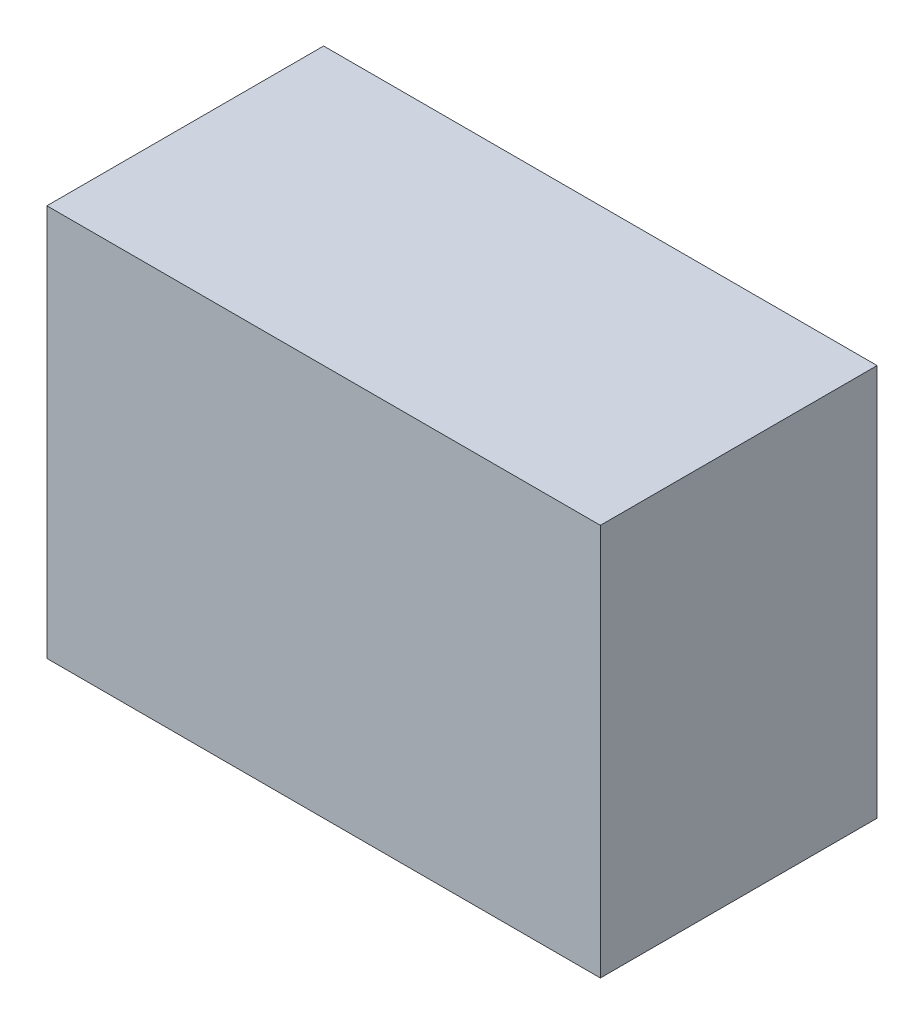
ISO-10303-21;
HEADER;
FILE_DESCRIPTION(('STEP AP214'),'2;1');
FILE_NAME('part.step','',(''),(''),'','','');
FILE_SCHEMA(('AUTOMOTIVE_DESIGN { 1 0 10303 214 1 1 1 1 }'));
ENDSEC;
DATA;
#1=APPLICATION_CONTEXT('core data for automotive mechanical design processes');
#2=APPLICATION_PROTOCOL_DEFINITION('international standard','automotive_design',2000,#1);
#3=PRODUCT_CONTEXT('',#1,'mechanical');
#4=PRODUCT('Part','Part','',(#3));
#5=PRODUCT_RELATED_PRODUCT_CATEGORY('part','',(#4));
#6=PRODUCT_DEFINITION_FORMATION('','',#4);
#7=PRODUCT_DEFINITION_CONTEXT('part definition',#1,'design');
#8=PRODUCT_DEFINITION('design','',#6,#7);
#9=PRODUCT_DEFINITION_SHAPE('','',#8);
#10=(LENGTH_UNIT() NAMED_UNIT(*) SI_UNIT(.MILLI.,.METRE.));
#11=(NAMED_UNIT(*) PLANE_ANGLE_UNIT() SI_UNIT($,.RADIAN.));
#12=(NAMED_UNIT(*) SI_UNIT($,.STERADIAN.) SOLID_ANGLE_UNIT());
#13=UNCERTAINTY_MEASURE_WITH_UNIT(LENGTH_MEASURE(1.E-05),#10,'distance_accuracy_value','');
#14=(GEOMETRIC_REPRESENTATION_CONTEXT(3) GLOBAL_UNCERTAINTY_ASSIGNED_CONTEXT((#13)) GLOBAL_UNIT_ASSIGNED_CONTEXT((#10,
#11,#12)) REPRESENTATION_CONTEXT('',''));
#15=CARTESIAN_POINT('',(0.,0.,0.));
#16=DIRECTION('',(0.,0.,1.));
#17=DIRECTION('',(1.,0.,0.));
#18=AXIS2_PLACEMENT_3D('',#15,#16,#17);
#19=CARTESIAN_POINT('',(-24.,34.,12.5453020134228));
#20=DIRECTION('',(0.,0.,-1.));
#21=DIRECTION('',(-1.,0.,0.));
#22=AXIS2_PLACEMENT_3D('',#19,#20,#21);
#23=PLANE('',#22);
#24=DIRECTION('',(1.,0.,0.));
#25=VECTOR('',#24,1.);
#26=CARTESIAN_POINT('',(-24.,0.,12.5453020134228));
#27=LINE('',#26,#25);
#28=CARTESIAN_POINT('',(-15.5,0.,12.5453020134228));
#29=VERTEX_POINT('',#28);
#30=CARTESIAN_POINT('',(15.5,0.,12.5453020134228));
#31=VERTEX_POINT('',#30);
#32=EDGE_CURVE('E48',#29,#31,#27,.T.);
#33=ORIENTED_EDGE('',*,*,#32,.F.);
#34=DIRECTION('',(0.,1.,0.));
#35=VECTOR('',#34,1.);
#36=CARTESIAN_POINT('',(-15.5,-18.3334139847093,12.5453020134228));
#37=LINE('',#36,#35);
#38=CARTESIAN_POINT('',(-15.5,32.,12.5453020134228));
#39=VERTEX_POINT('',#38);
#40=EDGE_CURVE('E295',#29,#39,#37,.T.);
#41=ORIENTED_EDGE('',*,*,#40,.T.);
#42=DIRECTION('',(1.,0.,0.));
#43=VECTOR('',#42,1.);
#44=CARTESIAN_POINT('',(-24.,32.,12.5453020134228));
#45=LINE('',#44,#43);
#46=CARTESIAN_POINT('',(15.5,32.,12.5453020134228));
#47=VERTEX_POINT('',#46);
#48=EDGE_CURVE('E173',#39,#47,#45,.T.);
#49=ORIENTED_EDGE('',*,*,#48,.T.);
#50=DIRECTION('',(0.,1.,0.));
#51=VECTOR('',#50,1.);
#52=CARTESIAN_POINT('',(15.5,-18.3334139847093,12.5453020134228));
#53=LINE('',#52,#51);
#54=EDGE_CURVE('E278',#31,#47,#53,.T.);
#55=ORIENTED_EDGE('',*,*,#54,.F.);
#56=EDGE_LOOP('',(#33,#41,#49,#55));
#57=FACE_BOUND('',#56,.T.);
#58=ADVANCED_FACE('F33',(#57),#23,.T.);
#59=CARTESIAN_POINT('',(0.,32.,0.));
#60=DIRECTION('',(0.,1.,0.));
#61=DIRECTION('',(0.,0.,1.));
#62=AXIS2_PLACEMENT_3D('',#59,#60,#61);
#63=PLANE('',#62);
#64=DIRECTION('',(0.,0.,1.));
#65=VECTOR('',#64,1.);
#66=CARTESIAN_POINT('',(-15.5,32.,-4.59716187992498));
#67=LINE('',#66,#65);
#68=CARTESIAN_POINT('',(-15.5,32.,-4.59716187992498));
#69=VERTEX_POINT('',#68);
#70=EDGE_CURVE('E166',#69,#39,#67,.T.);
#71=ORIENTED_EDGE('',*,*,#70,.F.);
#72=DIRECTION('',(1.,0.,0.));
#73=VECTOR('',#72,1.);
#74=CARTESIAN_POINT('',(-22.,32.,-4.59716187992498));
#75=LINE('',#74,#73);
#76=CARTESIAN_POINT('',(-22.,32.,-4.59716187992498));
#77=VERTEX_POINT('',#76);
#78=EDGE_CURVE('E150',#77,#69,#75,.T.);
#79=ORIENTED_EDGE('',*,*,#78,.F.);
#80=DIRECTION('',(0.,0.,1.));
#81=VECTOR('',#80,1.);
#82=CARTESIAN_POINT('',(-22.,32.,-9.45469798657719));
#83=LINE('',#82,#81);
#84=CARTESIAN_POINT('',(-22.,32.,-7.45469798657719));
#85=VERTEX_POINT('',#84);
#86=EDGE_CURVE('E164',#85,#77,#83,.T.);
#87=ORIENTED_EDGE('',*,*,#86,.F.);
#88=DIRECTION('',(-1.,0.,0.));
#89=VECTOR('',#88,1.);
#90=CARTESIAN_POINT('',(-24.,32.,-7.45469798657719));
#91=LINE('',#90,#89);
#92=CARTESIAN_POINT('',(22.,32.,-7.45469798657719));
#93=VERTEX_POINT('',#92);
#94=EDGE_CURVE('E186',#93,#85,#91,.T.);
#95=ORIENTED_EDGE('',*,*,#94,.F.);
#96=DIRECTION('',(0.,0.,-1.));
#97=VECTOR('',#96,1.);
#98=CARTESIAN_POINT('',(22.,32.,-9.45469798657719));
#99=LINE('',#98,#97);
#100=CARTESIAN_POINT('',(22.,32.,-4.59716187992498));
#101=VERTEX_POINT('',#100);
#102=EDGE_CURVE('E176',#101,#93,#99,.T.);
#103=ORIENTED_EDGE('',*,*,#102,.F.);
#104=DIRECTION('',(1.,0.,0.));
#105=VECTOR('',#104,1.);
#106=CARTESIAN_POINT('',(22.,32.,-4.59716187992498));
#107=LINE('',#106,#105);
#108=CARTESIAN_POINT('',(15.5,32.,-4.59716187992498));
#109=VERTEX_POINT('',#108);
#110=EDGE_CURVE('E286',#109,#101,#107,.T.);
#111=ORIENTED_EDGE('',*,*,#110,.F.);
#112=DIRECTION('',(0.,0.,-1.));
#113=VECTOR('',#112,1.);
#114=CARTESIAN_POINT('',(15.5,32.,-4.59716187992498));
#115=LINE('',#114,#113);
#116=EDGE_CURVE('E289',#47,#109,#115,.T.);
#117=ORIENTED_EDGE('',*,*,#116,.F.);
#118=ORIENTED_EDGE('',*,*,#48,.F.);
#119=EDGE_LOOP('',(#71,#79,#87,#95,#103,#111,#117,#118));
#120=FACE_BOUND('',#119,.T.);
#121=ADVANCED_FACE('F162',(#120),#63,.F.);
#122=CARTESIAN_POINT('',(-22.,34.,-9.45469798657719));
#123=DIRECTION('',(1.,0.,0.));
#124=DIRECTION('',(0.,0.,-1.));
#125=AXIS2_PLACEMENT_3D('',#122,#123,#124);
#126=PLANE('',#125);
#127=ORIENTED_EDGE('',*,*,#86,.T.);
#128=DIRECTION('',(0.,1.,0.));
#129=VECTOR('',#128,1.);
#130=CARTESIAN_POINT('',(-22.,-18.3334139847093,-4.59716187992498));
#131=LINE('',#130,#129);
#132=CARTESIAN_POINT('',(-22.,0.,-4.59716187992498));
#133=VERTEX_POINT('',#132);
#134=EDGE_CURVE('E146',#133,#77,#131,.T.);
#135=ORIENTED_EDGE('',*,*,#134,.F.);
#136=DIRECTION('',(0.,0.,1.));
#137=VECTOR('',#136,1.);
#138=CARTESIAN_POINT('',(-22.,0.,-9.45469798657719));
#139=LINE('',#138,#137);
#140=CARTESIAN_POINT('',(-22.,0.,-7.45469798657719));
#141=VERTEX_POINT('',#140);
#142=EDGE_CURVE('E192',#141,#133,#139,.T.);
#143=ORIENTED_EDGE('',*,*,#142,.F.);
#144=DIRECTION('',(0.,-1.,0.));
#145=VECTOR('',#144,1.);
#146=CARTESIAN_POINT('',(-22.,34.,-7.45469798657719));
#147=LINE('',#146,#145);
#148=EDGE_CURVE('E172',#85,#141,#147,.T.);
#149=ORIENTED_EDGE('',*,*,#148,.F.);
#150=EDGE_LOOP('',(#127,#135,#143,#149));
#151=FACE_BOUND('',#150,.T.);
#152=ADVANCED_FACE('F170',(#151),#126,.T.);
#153=CARTESIAN_POINT('',(22.,34.,-9.45469798657719));
#154=DIRECTION('',(-1.,0.,0.));
#155=DIRECTION('',(0.,0.,1.));
#156=AXIS2_PLACEMENT_3D('',#153,#154,#155);
#157=PLANE('',#156);
#158=DIRECTION('',(0.,0.,-1.));
#159=VECTOR('',#158,1.);
#160=CARTESIAN_POINT('',(22.,0.,-9.45469798657719));
#161=LINE('',#160,#159);
#162=CARTESIAN_POINT('',(22.,0.,-4.59716187992498));
#163=VERTEX_POINT('',#162);
#164=CARTESIAN_POINT('',(22.,0.,-7.45469798657719));
#165=VERTEX_POINT('',#164);
#166=EDGE_CURVE('E56',#163,#165,#161,.T.);
#167=ORIENTED_EDGE('',*,*,#166,.F.);
#168=DIRECTION('',(0.,1.,0.));
#169=VECTOR('',#168,1.);
#170=CARTESIAN_POINT('',(22.,-18.3334139847093,-4.59716187992498));
#171=LINE('',#170,#169);
#172=EDGE_CURVE('E284',#163,#101,#171,.T.);
#173=ORIENTED_EDGE('',*,*,#172,.T.);
#174=ORIENTED_EDGE('',*,*,#102,.T.);
#175=DIRECTION('',(0.,-1.,0.));
#176=VECTOR('',#175,1.);
#177=CARTESIAN_POINT('',(22.,34.,-7.45469798657719));
#178=LINE('',#177,#176);
#179=EDGE_CURVE('E185',#93,#165,#178,.T.);
#180=ORIENTED_EDGE('',*,*,#179,.T.);
#181=EDGE_LOOP('',(#167,#173,#174,#180));
#182=FACE_BOUND('',#181,.T.);
#183=ADVANCED_FACE('F353',(#182),#157,.T.);
#184=CARTESIAN_POINT('',(-24.,34.,-9.45469798657719));
#185=DIRECTION('',(1.,0.,0.));
#186=DIRECTION('',(0.,0.,-1.));
#187=AXIS2_PLACEMENT_3D('',#184,#185,#186);
#188=PLANE('',#187);
#189=DIRECTION('',(0.,0.,1.));
#190=VECTOR('',#189,1.);
#191=CARTESIAN_POINT('',(-24.,0.,-9.45469798657719));
#192=LINE('',#191,#190);
#193=CARTESIAN_POINT('',(-24.,0.,-9.45469798657719));
#194=VERTEX_POINT('',#193);
#195=CARTESIAN_POINT('',(-24.,0.,14.5453020134228));
#196=VERTEX_POINT('',#195);
#197=EDGE_CURVE('E189',#194,#196,#192,.T.);
#198=ORIENTED_EDGE('',*,*,#197,.T.);
#199=DIRECTION('',(0.,-1.,0.));
#200=VECTOR('',#199,1.);
#201=CARTESIAN_POINT('',(-24.,34.,14.5453020134228));
#202=LINE('',#201,#200);
#203=CARTESIAN_POINT('',(-24.,34.,14.5453020134228));
#204=VERTEX_POINT('',#203);
#205=EDGE_CURVE('E11',#204,#196,#202,.T.);
#206=ORIENTED_EDGE('',*,*,#205,.F.);
#207=DIRECTION('',(0.,0.,1.));
#208=VECTOR('',#207,1.);
#209=CARTESIAN_POINT('',(-24.,34.,-9.45469798657719));
#210=LINE('',#209,#208);
#211=CARTESIAN_POINT('',(-24.,34.,-9.45469798657719));
#212=VERTEX_POINT('',#211);
#213=EDGE_CURVE('E197',#212,#204,#210,.T.);
#214=ORIENTED_EDGE('',*,*,#213,.F.);
#215=DIRECTION('',(0.,-1.,0.));
#216=VECTOR('',#215,1.);
#217=CARTESIAN_POINT('',(-24.,34.,-9.45469798657719));
#218=LINE('',#217,#216);
#219=EDGE_CURVE('E207',#212,#194,#218,.T.);
#220=ORIENTED_EDGE('',*,*,#219,.T.);
#221=EDGE_LOOP('',(#198,#206,#214,#220));
#222=FACE_BOUND('',#221,.T.);
#223=ADVANCED_FACE('F35',(#222),#188,.F.);
#224=CARTESIAN_POINT('',(-24.,34.,14.5453020134228));
#225=DIRECTION('',(0.,0.,-1.));
#226=DIRECTION('',(-1.,0.,0.));
#227=AXIS2_PLACEMENT_3D('',#224,#225,#226);
#228=PLANE('',#227);
#229=DIRECTION('',(1.,0.,0.));
#230=VECTOR('',#229,1.);
#231=CARTESIAN_POINT('',(-24.,0.,14.5453020134228));
#232=LINE('',#231,#230);
#233=CARTESIAN_POINT('',(24.,0.,14.5453020134228));
#234=VERTEX_POINT('',#233);
#235=EDGE_CURVE('E210',#196,#234,#232,.T.);
#236=ORIENTED_EDGE('',*,*,#235,.T.);
#237=DIRECTION('',(0.,-1.,0.));
#238=VECTOR('',#237,1.);
#239=CARTESIAN_POINT('',(24.,34.,14.5453020134228));
#240=LINE('',#239,#238);
#241=CARTESIAN_POINT('',(24.,34.,14.5453020134228));
#242=VERTEX_POINT('',#241);
#243=EDGE_CURVE('E41',#242,#234,#240,.T.);
#244=ORIENTED_EDGE('',*,*,#243,.F.);
#245=DIRECTION('',(1.,0.,0.));
#246=VECTOR('',#245,1.);
#247=CARTESIAN_POINT('',(-24.,34.,14.5453020134228));
#248=LINE('',#247,#246);
#249=EDGE_CURVE('E200',#204,#242,#248,.T.);
#250=ORIENTED_EDGE('',*,*,#249,.F.);
#251=ORIENTED_EDGE('',*,*,#205,.T.);
#252=EDGE_LOOP('',(#236,#244,#250,#251));
#253=FACE_BOUND('',#252,.T.);
#254=ADVANCED_FACE('F244',(#253),#228,.F.);
#255=CARTESIAN_POINT('',(24.,34.,-9.45469798657719));
#256=DIRECTION('',(-1.,0.,0.));
#257=DIRECTION('',(0.,0.,1.));
#258=AXIS2_PLACEMENT_3D('',#255,#256,#257);
#259=PLANE('',#258);
#260=DIRECTION('',(0.,0.,-1.));
#261=VECTOR('',#260,1.);
#262=CARTESIAN_POINT('',(24.,0.,-9.45469798657719));
#263=LINE('',#262,#261);
#264=CARTESIAN_POINT('',(24.,0.,-9.45469798657719));
#265=VERTEX_POINT('',#264);
#266=EDGE_CURVE('E212',#234,#265,#263,.T.);
#267=ORIENTED_EDGE('',*,*,#266,.T.);
#268=DIRECTION('',(0.,-1.,0.));
#269=VECTOR('',#268,1.);
#270=CARTESIAN_POINT('',(24.,34.,-9.45469798657719));
#271=LINE('',#270,#269);
#272=CARTESIAN_POINT('',(24.,34.,-9.45469798657719));
#273=VERTEX_POINT('',#272);
#274=EDGE_CURVE('E219',#273,#265,#271,.T.);
#275=ORIENTED_EDGE('',*,*,#274,.F.);
#276=DIRECTION('',(0.,0.,-1.));
#277=VECTOR('',#276,1.);
#278=CARTESIAN_POINT('',(24.,34.,-9.45469798657719));
#279=LINE('',#278,#277);
#280=EDGE_CURVE('E203',#242,#273,#279,.T.);
#281=ORIENTED_EDGE('',*,*,#280,.F.);
#282=ORIENTED_EDGE('',*,*,#243,.T.);
#283=EDGE_LOOP('',(#267,#275,#281,#282));
#284=FACE_BOUND('',#283,.T.);
#285=ADVANCED_FACE('F226',(#284),#259,.F.);
#286=CARTESIAN_POINT('',(-24.,34.,-9.45469798657719));
#287=DIRECTION('',(0.,0.,1.));
#288=DIRECTION('',(1.,0.,0.));
#289=AXIS2_PLACEMENT_3D('',#286,#287,#288);
#290=PLANE('',#289);
#291=DIRECTION('',(-1.,0.,0.));
#292=VECTOR('',#291,1.);
#293=CARTESIAN_POINT('',(-24.,0.,-9.45469798657719));
#294=LINE('',#293,#292);
#295=CARTESIAN_POINT('',(6.50257774623224,0.,-9.45469798657719));
#296=VERTEX_POINT('',#295);
#297=EDGE_CURVE('E201',#265,#296,#294,.T.);
#298=ORIENTED_EDGE('',*,*,#297,.T.);
#299=DIRECTION('',(0.,-1.,0.));
#300=VECTOR('',#299,1.);
#301=CARTESIAN_POINT('',(6.50257774623224,0.,-9.45469798657719));
#302=LINE('',#301,#300);
#303=CARTESIAN_POINT('',(6.50257774623224,25.,-9.45469798657719));
#304=VERTEX_POINT('',#303);
#305=EDGE_CURVE('E237',#304,#296,#302,.T.);
#306=ORIENTED_EDGE('',*,*,#305,.F.);
#307=CARTESIAN_POINT('',(0.,25.,-9.45469798657719));
#308=DIRECTION('',(0.,0.,-1.));
#309=DIRECTION('',(-1.,0.,0.));
#310=AXIS2_PLACEMENT_3D('',#307,#308,#309);
#311=CIRCLE('',#310,6.50257774623224);
#312=CARTESIAN_POINT('',(-6.50257774623224,25.,-9.45469798657719));
#313=VERTEX_POINT('',#312);
#314=EDGE_CURVE('E254',#313,#304,#311,.T.);
#315=ORIENTED_EDGE('',*,*,#314,.F.);
#316=DIRECTION('',(0.,1.,0.));
#317=VECTOR('',#316,1.);
#318=CARTESIAN_POINT('',(-6.50257774623224,0.,-9.45469798657719));
#319=LINE('',#318,#317);
#320=CARTESIAN_POINT('',(-6.50257774623224,0.,-9.45469798657719));
#321=VERTEX_POINT('',#320);
#322=EDGE_CURVE('E252',#321,#313,#319,.T.);
#323=ORIENTED_EDGE('',*,*,#322,.F.);
#324=EDGE_CURVE('E214',#321,#194,#294,.T.);
#325=ORIENTED_EDGE('',*,*,#324,.T.);
#326=ORIENTED_EDGE('',*,*,#219,.F.);
#327=DIRECTION('',(-1.,0.,0.));
#328=VECTOR('',#327,1.);
#329=CARTESIAN_POINT('',(-24.,34.,-9.45469798657719));
#330=LINE('',#329,#328);
#331=EDGE_CURVE('E205',#273,#212,#330,.T.);
#332=ORIENTED_EDGE('',*,*,#331,.F.);
#333=ORIENTED_EDGE('',*,*,#274,.T.);
#334=EDGE_LOOP('',(#298,#306,#315,#323,#325,#326,#332,#333));
#335=FACE_BOUND('',#334,.T.);
#336=ADVANCED_FACE('F235',(#335),#290,.F.);
#337=CARTESIAN_POINT('',(0.,34.,0.));
#338=DIRECTION('',(0.,1.,0.));
#339=DIRECTION('',(0.,0.,1.));
#340=AXIS2_PLACEMENT_3D('',#337,#338,#339);
#341=PLANE('',#340);
#342=ORIENTED_EDGE('',*,*,#213,.T.);
#343=ORIENTED_EDGE('',*,*,#249,.T.);
#344=ORIENTED_EDGE('',*,*,#280,.T.);
#345=ORIENTED_EDGE('',*,*,#331,.T.);
#346=EDGE_LOOP('',(#342,#343,#344,#345));
#347=FACE_BOUND('',#346,.T.);
#348=ADVANCED_FACE('F242',(#347),#341,.T.);
#349=CARTESIAN_POINT('',(0.,0.,0.));
#350=DIRECTION('',(0.,1.,0.));
#351=DIRECTION('',(0.,0.,1.));
#352=AXIS2_PLACEMENT_3D('',#349,#350,#351);
#353=PLANE('',#352);
#354=CARTESIAN_POINT('',(-20.,0.,5.54530201342281));
#355=DIRECTION('',(0.,-1.,0.));
#356=DIRECTION('',(0.,0.,-1.));
#357=AXIS2_PLACEMENT_3D('',#354,#355,#356);
#358=CIRCLE('',#357,1.75);
#359=CARTESIAN_POINT('',(-20.,0.,3.79530201342281));
#360=VERTEX_POINT('',#359);
#361=EDGE_CURVE('E308',#360,#360,#358,.T.);
#362=ORIENTED_EDGE('',*,*,#361,.F.);
#363=EDGE_LOOP('',(#362));
#364=FACE_BOUND('',#363,.T.);
#365=CARTESIAN_POINT('',(20.,0.,5.54530201342281));
#366=DIRECTION('',(0.,-1.,0.));
#367=DIRECTION('',(0.,0.,-1.));
#368=AXIS2_PLACEMENT_3D('',#365,#366,#367);
#369=CIRCLE('',#368,1.75);
#370=CARTESIAN_POINT('',(20.,0.,3.79530201342281));
#371=VERTEX_POINT('',#370);
#372=EDGE_CURVE('E302',#371,#371,#369,.T.);
#373=ORIENTED_EDGE('',*,*,#372,.F.);
#374=EDGE_LOOP('',(#373));
#375=FACE_BOUND('',#374,.T.);
#376=DIRECTION('',(0.,0.,-1.));
#377=VECTOR('',#376,1.);
#378=CARTESIAN_POINT('',(-15.5,0.,-4.59716187992498));
#379=LINE('',#378,#377);
#380=CARTESIAN_POINT('',(-15.5,0.,-4.59716187992498));
#381=VERTEX_POINT('',#380);
#382=EDGE_CURVE('E157',#29,#381,#379,.T.);
#383=ORIENTED_EDGE('',*,*,#382,.F.);
#384=ORIENTED_EDGE('',*,*,#32,.T.);
#385=DIRECTION('',(0.,0.,1.));
#386=VECTOR('',#385,1.);
#387=CARTESIAN_POINT('',(15.5,0.,-4.59716187992498));
#388=LINE('',#387,#386);
#389=CARTESIAN_POINT('',(15.5,0.,-4.59716187992498));
#390=VERTEX_POINT('',#389);
#391=EDGE_CURVE('E260',#390,#31,#388,.T.);
#392=ORIENTED_EDGE('',*,*,#391,.F.);
#393=DIRECTION('',(-1.,0.,0.));
#394=VECTOR('',#393,1.);
#395=CARTESIAN_POINT('',(22.,0.,-4.59716187992498));
#396=LINE('',#395,#394);
#397=EDGE_CURVE('E275',#163,#390,#396,.T.);
#398=ORIENTED_EDGE('',*,*,#397,.F.);
#399=ORIENTED_EDGE('',*,*,#166,.T.);
#400=DIRECTION('',(-1.,0.,0.));
#401=VECTOR('',#400,1.);
#402=CARTESIAN_POINT('',(-24.,0.,-7.45469798657719));
#403=LINE('',#402,#401);
#404=CARTESIAN_POINT('',(6.50257774623224,0.,-7.45469798657719));
#405=VERTEX_POINT('',#404);
#406=EDGE_CURVE('E174',#165,#405,#403,.T.);
#407=ORIENTED_EDGE('',*,*,#406,.T.);
#408=DIRECTION('',(0.,0.,-1.));
#409=VECTOR('',#408,1.);
#410=CARTESIAN_POINT('',(6.50257774623224,0.,-7.45469798657719));
#411=LINE('',#410,#409);
#412=EDGE_CURVE('E183',#405,#296,#411,.T.);
#413=ORIENTED_EDGE('',*,*,#412,.T.);
#414=ORIENTED_EDGE('',*,*,#297,.F.);
#415=ORIENTED_EDGE('',*,*,#266,.F.);
#416=ORIENTED_EDGE('',*,*,#235,.F.);
#417=ORIENTED_EDGE('',*,*,#197,.F.);
#418=ORIENTED_EDGE('',*,*,#324,.F.);
#419=DIRECTION('',(0.,0.,-1.));
#420=VECTOR('',#419,1.);
#421=CARTESIAN_POINT('',(-6.50257774623224,0.,-7.45469798657719));
#422=LINE('',#421,#420);
#423=CARTESIAN_POINT('',(-6.50257774623224,0.,-7.45469798657719));
#424=VERTEX_POINT('',#423);
#425=EDGE_CURVE('E248',#424,#321,#422,.T.);
#426=ORIENTED_EDGE('',*,*,#425,.F.);
#427=EDGE_CURVE('E179',#424,#141,#403,.T.);
#428=ORIENTED_EDGE('',*,*,#427,.T.);
#429=ORIENTED_EDGE('',*,*,#142,.T.);
#430=DIRECTION('',(-1.,0.,0.));
#431=VECTOR('',#430,1.);
#432=CARTESIAN_POINT('',(-22.,0.,-4.59716187992498));
#433=LINE('',#432,#431);
#434=EDGE_CURVE('E152',#381,#133,#433,.T.);
#435=ORIENTED_EDGE('',*,*,#434,.F.);
#436=EDGE_LOOP('',(#383,#384,#392,#398,#399,#407,#413,#414,#415,#416,#417,#418,#426,#428,#429,#435));
#437=FACE_BOUND('',#436,.T.);
#438=ADVANCED_FACE('F230',(#364,#375,#437),#353,.F.);
#439=CARTESIAN_POINT('',(-24.,34.,-7.45469798657719));
#440=DIRECTION('',(0.,0.,1.));
#441=DIRECTION('',(1.,0.,0.));
#442=AXIS2_PLACEMENT_3D('',#439,#440,#441);
#443=PLANE('',#442);
#444=DIRECTION('',(0.,-1.,0.));
#445=VECTOR('',#444,1.);
#446=CARTESIAN_POINT('',(6.50257774623224,0.,-7.45469798657719));
#447=LINE('',#446,#445);
#448=CARTESIAN_POINT('',(6.50257774623224,25.,-7.45469798657719));
#449=VERTEX_POINT('',#448);
#450=EDGE_CURVE('E258',#449,#405,#447,.T.);
#451=ORIENTED_EDGE('',*,*,#450,.T.);
#452=ORIENTED_EDGE('',*,*,#406,.F.);
#453=ORIENTED_EDGE('',*,*,#179,.F.);
#454=ORIENTED_EDGE('',*,*,#94,.T.);
#455=ORIENTED_EDGE('',*,*,#148,.T.);
#456=ORIENTED_EDGE('',*,*,#427,.F.);
#457=DIRECTION('',(0.,1.,0.));
#458=VECTOR('',#457,1.);
#459=CARTESIAN_POINT('',(-6.50257774623224,0.,-7.45469798657719));
#460=LINE('',#459,#458);
#461=CARTESIAN_POINT('',(-6.50257774623225,25.,-7.45469798657719));
#462=VERTEX_POINT('',#461);
#463=EDGE_CURVE('E268',#424,#462,#460,.T.);
#464=ORIENTED_EDGE('',*,*,#463,.T.);
#465=CARTESIAN_POINT('',(0.,25.,-7.45469798657719));
#466=DIRECTION('',(0.,0.,-1.));
#467=DIRECTION('',(-1.,0.,0.));
#468=AXIS2_PLACEMENT_3D('',#465,#466,#467);
#469=CIRCLE('',#468,6.50257774623224);
#470=EDGE_CURVE('E266',#462,#449,#469,.T.);
#471=ORIENTED_EDGE('',*,*,#470,.T.);
#472=EDGE_LOOP('',(#451,#452,#453,#454,#455,#456,#464,#471));
#473=FACE_BOUND('',#472,.T.);
#474=ADVANCED_FACE('F325',(#473),#443,.T.);
#475=CARTESIAN_POINT('',(6.50257774623224,0.,-7.45469798657719));
#476=DIRECTION('',(1.,0.,0.));
#477=DIRECTION('',(0.,0.,-1.));
#478=AXIS2_PLACEMENT_3D('',#475,#476,#477);
#479=PLANE('',#478);
#480=ORIENTED_EDGE('',*,*,#305,.T.);
#481=ORIENTED_EDGE('',*,*,#412,.F.);
#482=ORIENTED_EDGE('',*,*,#450,.F.);
#483=DIRECTION('',(0.,0.,-1.));
#484=VECTOR('',#483,1.);
#485=CARTESIAN_POINT('',(6.50257774623224,25.,-7.45469798657719));
#486=LINE('',#485,#484);
#487=EDGE_CURVE('E193',#449,#304,#486,.T.);
#488=ORIENTED_EDGE('',*,*,#487,.T.);
#489=EDGE_LOOP('',(#480,#481,#482,#488));
#490=FACE_BOUND('',#489,.T.);
#491=ADVANCED_FACE('F357',(#490),#479,.F.);
#492=CARTESIAN_POINT('',(0.,25.,-7.45469798657719));
#493=DIRECTION('',(0.,0.,-1.));
#494=DIRECTION('',(-1.,0.,0.));
#495=AXIS2_PLACEMENT_3D('',#492,#493,#494);
#496=CYLINDRICAL_SURFACE('',#495,6.50257774623224);
#497=ORIENTED_EDGE('',*,*,#314,.T.);
#498=ORIENTED_EDGE('',*,*,#487,.F.);
#499=ORIENTED_EDGE('',*,*,#470,.F.);
#500=DIRECTION('',(0.,0.,-1.));
#501=VECTOR('',#500,1.);
#502=CARTESIAN_POINT('',(-6.50257774623224,25.,-7.45469798657719));
#503=LINE('',#502,#501);
#504=EDGE_CURVE('E265',#462,#313,#503,.T.);
#505=ORIENTED_EDGE('',*,*,#504,.T.);
#506=EDGE_LOOP('',(#497,#498,#499,#505));
#507=FACE_BOUND('',#506,.T.);
#508=ADVANCED_FACE('F400',(#507),#496,.F.);
#509=CARTESIAN_POINT('',(-6.50257774623224,0.,-7.45469798657719));
#510=DIRECTION('',(-1.,0.,0.));
#511=DIRECTION('',(0.,-1.,0.));
#512=AXIS2_PLACEMENT_3D('',#509,#510,#511);
#513=PLANE('',#512);
#514=ORIENTED_EDGE('',*,*,#322,.T.);
#515=ORIENTED_EDGE('',*,*,#504,.F.);
#516=ORIENTED_EDGE('',*,*,#463,.F.);
#517=ORIENTED_EDGE('',*,*,#425,.T.);
#518=EDGE_LOOP('',(#514,#515,#516,#517));
#519=FACE_BOUND('',#518,.T.);
#520=ADVANCED_FACE('F394',(#519),#513,.F.);
#521=CARTESIAN_POINT('',(22.,-18.3334139847093,-4.59716187992498));
#522=DIRECTION('',(0.,0.,1.));
#523=DIRECTION('',(1.,0.,0.));
#524=AXIS2_PLACEMENT_3D('',#521,#522,#523);
#525=PLANE('',#524);
#526=ORIENTED_EDGE('',*,*,#172,.F.);
#527=ORIENTED_EDGE('',*,*,#397,.T.);
#528=DIRECTION('',(0.,1.,0.));
#529=VECTOR('',#528,1.);
#530=CARTESIAN_POINT('',(15.5,-18.3334139847093,-4.59716187992498));
#531=LINE('',#530,#529);
#532=EDGE_CURVE('E281',#390,#109,#531,.T.);
#533=ORIENTED_EDGE('',*,*,#532,.T.);
#534=ORIENTED_EDGE('',*,*,#110,.T.);
#535=EDGE_LOOP('',(#526,#527,#533,#534));
#536=FACE_BOUND('',#535,.T.);
#537=ADVANCED_FACE('F399',(#536),#525,.F.);
#538=CARTESIAN_POINT('',(15.5,-18.3334139847093,-4.59716187992498));
#539=DIRECTION('',(1.,0.,0.));
#540=DIRECTION('',(0.,0.,-1.));
#541=AXIS2_PLACEMENT_3D('',#538,#539,#540);
#542=PLANE('',#541);
#543=ORIENTED_EDGE('',*,*,#532,.F.);
#544=ORIENTED_EDGE('',*,*,#391,.T.);
#545=ORIENTED_EDGE('',*,*,#54,.T.);
#546=ORIENTED_EDGE('',*,*,#116,.T.);
#547=EDGE_LOOP('',(#543,#544,#545,#546));
#548=FACE_BOUND('',#547,.T.);
#549=ADVANCED_FACE('F495',(#548),#542,.F.);
#550=CARTESIAN_POINT('',(-15.5,-18.3334139847093,-4.59716187992498));
#551=DIRECTION('',(-1.,0.,0.));
#552=DIRECTION('',(0.,0.,1.));
#553=AXIS2_PLACEMENT_3D('',#550,#551,#552);
#554=PLANE('',#553);
#555=ORIENTED_EDGE('',*,*,#40,.F.);
#556=ORIENTED_EDGE('',*,*,#382,.T.);
#557=DIRECTION('',(0.,1.,0.));
#558=VECTOR('',#557,1.);
#559=CARTESIAN_POINT('',(-15.5,-18.3334139847093,-4.59716187992498));
#560=LINE('',#559,#558);
#561=EDGE_CURVE('E158',#381,#69,#560,.T.);
#562=ORIENTED_EDGE('',*,*,#561,.T.);
#563=ORIENTED_EDGE('',*,*,#70,.T.);
#564=EDGE_LOOP('',(#555,#556,#562,#563));
#565=FACE_BOUND('',#564,.T.);
#566=ADVANCED_FACE('F339',(#565),#554,.F.);
#567=CARTESIAN_POINT('',(-22.,-18.3334139847093,-4.59716187992498));
#568=DIRECTION('',(0.,0.,1.));
#569=DIRECTION('',(1.,0.,0.));
#570=AXIS2_PLACEMENT_3D('',#567,#568,#569);
#571=PLANE('',#570);
#572=ORIENTED_EDGE('',*,*,#561,.F.);
#573=ORIENTED_EDGE('',*,*,#434,.T.);
#574=ORIENTED_EDGE('',*,*,#134,.T.);
#575=ORIENTED_EDGE('',*,*,#78,.T.);
#576=EDGE_LOOP('',(#572,#573,#574,#575));
#577=FACE_BOUND('',#576,.T.);
#578=ADVANCED_FACE('F149',(#577),#571,.F.);
#579=CARTESIAN_POINT('',(20.,10.,5.54530201342281));
#580=DIRECTION('',(0.,-1.,0.));
#581=DIRECTION('',(0.,0.,-1.));
#582=AXIS2_PLACEMENT_3D('',#579,#580,#581);
#583=CYLINDRICAL_SURFACE('',#582,1.75);
#584=CARTESIAN_POINT('',(20.,10.,5.54530201342281));
#585=DIRECTION('',(0.,-1.,0.));
#586=DIRECTION('',(0.,0.,-1.));
#587=AXIS2_PLACEMENT_3D('',#584,#585,#586);
#588=CIRCLE('',#587,1.75);
#589=CARTESIAN_POINT('',(20.,10.,3.79530201342281));
#590=VERTEX_POINT('',#589);
#591=EDGE_CURVE('E167',#590,#590,#588,.T.);
#592=ORIENTED_EDGE('',*,*,#591,.F.);
#593=EDGE_LOOP('',(#592));
#594=FACE_BOUND('',#593,.T.);
#595=ORIENTED_EDGE('',*,*,#372,.T.);
#596=EDGE_LOOP('',(#595));
#597=FACE_BOUND('',#596,.T.);
#598=ADVANCED_FACE('F329',(#594,#597),#583,.F.);
#599=CARTESIAN_POINT('',(20.,10.,5.54530201342281));
#600=DIRECTION('',(0.,-1.,0.));
#601=DIRECTION('',(0.,0.,-1.));
#602=AXIS2_PLACEMENT_3D('',#599,#600,#601);
#603=PLANE('',#602);
#604=ORIENTED_EDGE('',*,*,#591,.T.);
#605=EDGE_LOOP('',(#604));
#606=FACE_BOUND('',#605,.T.);
#607=ADVANCED_FACE('F319',(#606),#603,.T.);
#608=CARTESIAN_POINT('',(-20.,10.,5.54530201342281));
#609=DIRECTION('',(0.,-1.,0.));
#610=DIRECTION('',(0.,0.,-1.));
#611=AXIS2_PLACEMENT_3D('',#608,#609,#610);
#612=CYLINDRICAL_SURFACE('',#611,1.75);
#613=CARTESIAN_POINT('',(-20.,10.,5.54530201342281));
#614=DIRECTION('',(0.,-1.,0.));
#615=DIRECTION('',(0.,0.,-1.));
#616=AXIS2_PLACEMENT_3D('',#613,#614,#615);
#617=CIRCLE('',#616,1.75);
#618=CARTESIAN_POINT('',(-20.,10.,3.79530201342281));
#619=VERTEX_POINT('',#618);
#620=EDGE_CURVE('E305',#619,#619,#617,.T.);
#621=ORIENTED_EDGE('',*,*,#620,.F.);
#622=EDGE_LOOP('',(#621));
#623=FACE_BOUND('',#622,.T.);
#624=ORIENTED_EDGE('',*,*,#361,.T.);
#625=EDGE_LOOP('',(#624));
#626=FACE_BOUND('',#625,.T.);
#627=ADVANCED_FACE('F316',(#623,#626),#612,.F.);
#628=CARTESIAN_POINT('',(-20.,10.,5.54530201342281));
#629=DIRECTION('',(0.,-1.,0.));
#630=DIRECTION('',(0.,0.,-1.));
#631=AXIS2_PLACEMENT_3D('',#628,#629,#630);
#632=PLANE('',#631);
#633=ORIENTED_EDGE('',*,*,#620,.T.);
#634=EDGE_LOOP('',(#633));
#635=FACE_BOUND('',#634,.T.);
#636=ADVANCED_FACE('F314',(#635),#632,.T.);
#637=CLOSED_SHELL('',(#58,#121,#152,#183,#223,#254,#285,#336,#348,#438,#474,#491,#508,#520,#537,
#549,#566,#578,#598,#607,#627,#636));
#638=MANIFOLD_SOLID_BREP('B2',#637);
#639=ADVANCED_BREP_SHAPE_REPRESENTATION('',(#18,#638),#14);
#640=SHAPE_DEFINITION_REPRESENTATION(#9,#639);
ENDSEC;
END-ISO-10303-21;
